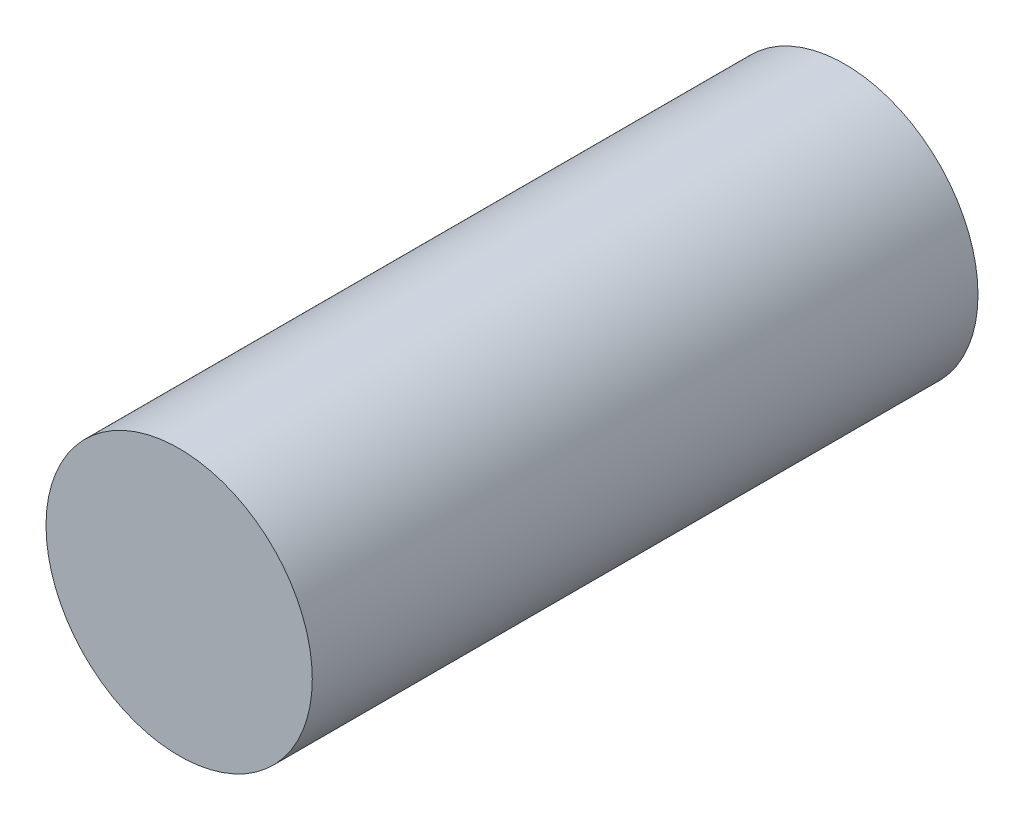
ISO-10303-21;
HEADER;
FILE_DESCRIPTION(('STEP AP214'),'2;1');
FILE_NAME('part.step','',(''),(''),'','','');
FILE_SCHEMA(('AUTOMOTIVE_DESIGN { 1 0 10303 214 1 1 1 1 }'));
ENDSEC;
DATA;
#1=APPLICATION_CONTEXT('core data for automotive mechanical design processes');
#2=APPLICATION_PROTOCOL_DEFINITION('international standard','automotive_design',2000,#1);
#3=PRODUCT_CONTEXT('',#1,'mechanical');
#4=PRODUCT('Part','Part','',(#3));
#5=PRODUCT_RELATED_PRODUCT_CATEGORY('part','',(#4));
#6=PRODUCT_DEFINITION_FORMATION('','',#4);
#7=PRODUCT_DEFINITION_CONTEXT('part definition',#1,'design');
#8=PRODUCT_DEFINITION('design','',#6,#7);
#9=PRODUCT_DEFINITION_SHAPE('','',#8);
#10=(LENGTH_UNIT() NAMED_UNIT(*) SI_UNIT(.MILLI.,.METRE.));
#11=(NAMED_UNIT(*) PLANE_ANGLE_UNIT() SI_UNIT($,.RADIAN.));
#12=(NAMED_UNIT(*) SI_UNIT($,.STERADIAN.) SOLID_ANGLE_UNIT());
#13=UNCERTAINTY_MEASURE_WITH_UNIT(LENGTH_MEASURE(1.E-05),#10,'distance_accuracy_value','');
#14=(GEOMETRIC_REPRESENTATION_CONTEXT(3) GLOBAL_UNCERTAINTY_ASSIGNED_CONTEXT((#13)) GLOBAL_UNIT_ASSIGNED_CONTEXT((#10,
#11,#12)) REPRESENTATION_CONTEXT('',''));
#15=CARTESIAN_POINT('',(0.,0.,0.));
#16=DIRECTION('',(0.,0.,1.));
#17=DIRECTION('',(1.,0.,0.));
#18=AXIS2_PLACEMENT_3D('',#15,#16,#17);
#19=CARTESIAN_POINT('',(0.,0.,20.));
#20=DIRECTION('',(0.,0.,-1.));
#21=DIRECTION('',(-1.,0.,0.));
#22=AXIS2_PLACEMENT_3D('',#19,#20,#21);
#23=CYLINDRICAL_SURFACE('',#22,4.);
#24=CARTESIAN_POINT('',(0.,0.,20.));
#25=DIRECTION('',(0.,0.,1.));
#26=DIRECTION('',(1.,0.,0.));
#27=AXIS2_PLACEMENT_3D('',#24,#25,#26);
#28=CIRCLE('',#27,4.);
#29=CARTESIAN_POINT('',(4.,0.,20.));
#30=VERTEX_POINT('',#29);
#31=EDGE_CURVE('E10',#30,#30,#28,.T.);
#32=ORIENTED_EDGE('',*,*,#31,.F.);
#33=EDGE_LOOP('',(#32));
#34=FACE_BOUND('',#33,.T.);
#35=CARTESIAN_POINT('',(0.,0.,0.));
#36=DIRECTION('',(0.,0.,1.));
#37=DIRECTION('',(1.,0.,0.));
#38=AXIS2_PLACEMENT_3D('',#35,#36,#37);
#39=CIRCLE('',#38,4.);
#40=CARTESIAN_POINT('',(4.,0.,0.));
#41=VERTEX_POINT('',#40);
#42=EDGE_CURVE('E40',#41,#41,#39,.T.);
#43=ORIENTED_EDGE('',*,*,#42,.T.);
#44=EDGE_LOOP('',(#43));
#45=FACE_BOUND('',#44,.T.);
#46=ADVANCED_FACE('F37',(#34,#45),#23,.T.);
#47=CARTESIAN_POINT('',(0.,0.,20.));
#48=DIRECTION('',(0.,0.,1.));
#49=DIRECTION('',(1.,0.,0.));
#50=AXIS2_PLACEMENT_3D('',#47,#48,#49);
#51=PLANE('',#50);
#52=ORIENTED_EDGE('',*,*,#31,.T.);
#53=EDGE_LOOP('',(#52));
#54=FACE_BOUND('',#53,.T.);
#55=ADVANCED_FACE('F54',(#54),#51,.T.);
#56=CARTESIAN_POINT('',(0.,0.,0.));
#57=DIRECTION('',(0.,0.,1.));
#58=DIRECTION('',(1.,0.,0.));
#59=AXIS2_PLACEMENT_3D('',#56,#57,#58);
#60=PLANE('',#59);
#61=ORIENTED_EDGE('',*,*,#42,.F.);
#62=EDGE_LOOP('',(#61));
#63=FACE_BOUND('',#62,.T.);
#64=ADVANCED_FACE('F52',(#63),#60,.F.);
#65=CLOSED_SHELL('',(#46,#55,#64));
#66=MANIFOLD_SOLID_BREP('B2',#65);
#67=ADVANCED_BREP_SHAPE_REPRESENTATION('',(#18,#66),#14);
#68=SHAPE_DEFINITION_REPRESENTATION(#9,#67);
ENDSEC;
END-ISO-10303-21;
